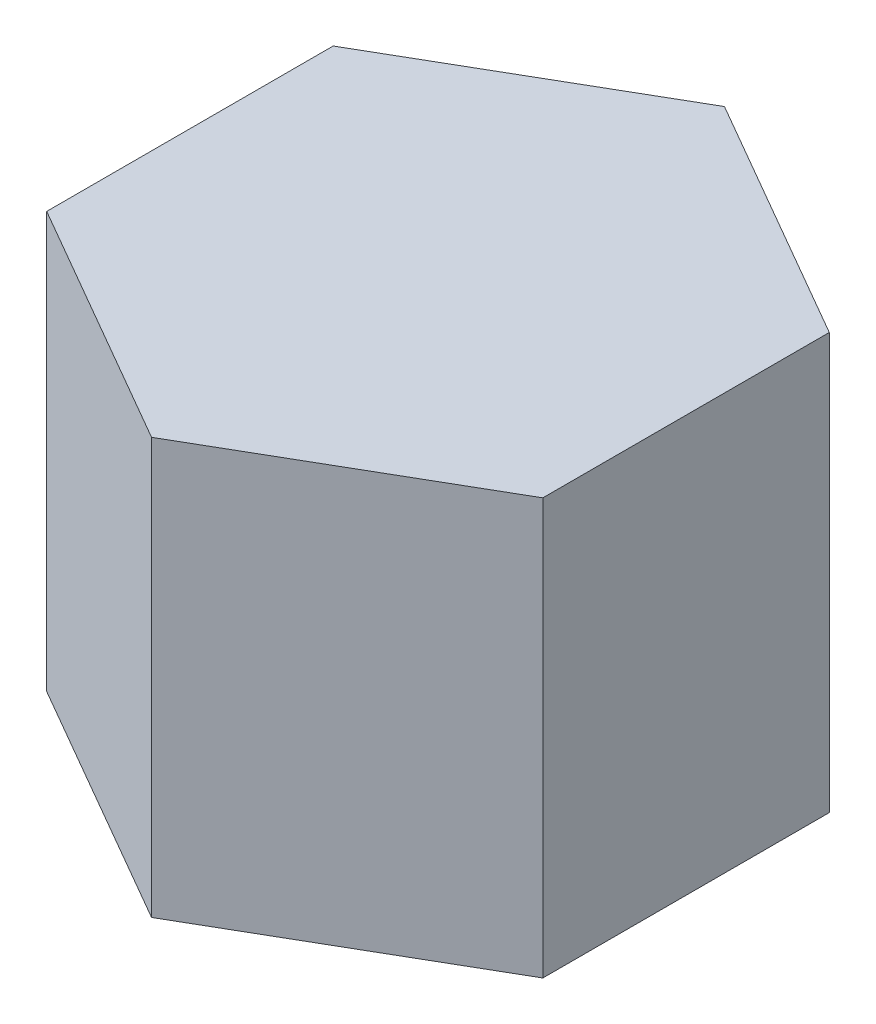
ISO-10303-21;
HEADER;
FILE_DESCRIPTION(('STEP AP214'),'2;1');
FILE_NAME('part.step','',(''),(''),'','','');
FILE_SCHEMA(('AUTOMOTIVE_DESIGN { 1 0 10303 214 1 1 1 1 }'));
ENDSEC;
DATA;
#1=APPLICATION_CONTEXT('core data for automotive mechanical design processes');
#2=APPLICATION_PROTOCOL_DEFINITION('international standard','automotive_design',2000,#1);
#3=PRODUCT_CONTEXT('',#1,'mechanical');
#4=PRODUCT('Part','Part','',(#3));
#5=PRODUCT_RELATED_PRODUCT_CATEGORY('part','',(#4));
#6=PRODUCT_DEFINITION_FORMATION('','',#4);
#7=PRODUCT_DEFINITION_CONTEXT('part definition',#1,'design');
#8=PRODUCT_DEFINITION('design','',#6,#7);
#9=PRODUCT_DEFINITION_SHAPE('','',#8);
#10=(LENGTH_UNIT() NAMED_UNIT(*) SI_UNIT(.MILLI.,.METRE.));
#11=(NAMED_UNIT(*) PLANE_ANGLE_UNIT() SI_UNIT($,.RADIAN.));
#12=(NAMED_UNIT(*) SI_UNIT($,.STERADIAN.) SOLID_ANGLE_UNIT());
#13=UNCERTAINTY_MEASURE_WITH_UNIT(LENGTH_MEASURE(1.E-05),#10,'distance_accuracy_value','');
#14=(GEOMETRIC_REPRESENTATION_CONTEXT(3) GLOBAL_UNCERTAINTY_ASSIGNED_CONTEXT((#13)) GLOBAL_UNIT_ASSIGNED_CONTEXT((#10,
#11,#12)) REPRESENTATION_CONTEXT('',''));
#15=CARTESIAN_POINT('',(0.,0.,0.));
#16=DIRECTION('',(0.,0.,1.));
#17=DIRECTION('',(1.,0.,0.));
#18=AXIS2_PLACEMENT_3D('',#15,#16,#17);
#19=CARTESIAN_POINT('',(202.142660308706,-148.537700895744,294.105047431848));
#20=DIRECTION('',(-0.500000000000028,0.,-0.866025403784423));
#21=DIRECTION('',(-0.866025403784423,0.,0.500000000000028));
#22=AXIS2_PLACEMENT_3D('',#19,#20,#21);
#23=PLANE('',#22);
#24=CARTESIAN_POINT('',(201.839551417382,-149.045793579175,294.280047431848));
#25=DIRECTION('',(0.866025403784422,0.,-0.500000000000028));
#26=VECTOR('',#25,1.);
#27=LINE('',#24,#26);
#28=CARTESIAN_POINT('',(201.839551417382,-149.045793579175,294.280047431848));
#29=VERTEX_POINT('',#28);
#30=CARTESIAN_POINT('',(202.142660308706,-149.045793579175,294.105047431848));
#31=VERTEX_POINT('',#30);
#32=EDGE_CURVE('E170',#29,#31,#27,.T.);
#33=ORIENTED_EDGE('',*,*,#32,.T.);
#34=CARTESIAN_POINT('',(202.142660308706,-148.537700895744,294.105047431848));
#35=DIRECTION('',(0.,-1.,0.));
#36=VECTOR('',#35,1.);
#37=LINE('',#34,#36);
#38=CARTESIAN_POINT('',(202.142660308706,-148.537700895744,294.105047431848));
#39=VERTEX_POINT('',#38);
#40=EDGE_CURVE('E35',#39,#31,#37,.T.);
#41=ORIENTED_EDGE('',*,*,#40,.F.);
#42=CARTESIAN_POINT('',(201.839551417382,-148.537700895744,294.280047431848));
#43=DIRECTION('',(0.866025403784422,0.,-0.500000000000028));
#44=VECTOR('',#43,1.);
#45=LINE('',#42,#44);
#46=CARTESIAN_POINT('',(201.839551417382,-148.537700895744,294.280047431848));
#47=VERTEX_POINT('',#46);
#48=EDGE_CURVE('E159',#47,#39,#45,.T.);
#49=ORIENTED_EDGE('',*,*,#48,.F.);
#50=CARTESIAN_POINT('',(201.839551417382,-148.537700895744,294.280047431848));
#51=DIRECTION('',(0.,-1.,0.));
#52=VECTOR('',#51,1.);
#53=LINE('',#50,#52);
#54=EDGE_CURVE('E10',#47,#29,#53,.T.);
#55=ORIENTED_EDGE('',*,*,#54,.T.);
#56=EDGE_LOOP('',(#33,#41,#49,#55));
#57=FACE_BOUND('',#56,.T.);
#58=ADVANCED_FACE('F16',(#57),#23,.F.);
#59=CARTESIAN_POINT('',(201.839551417382,-148.537700895744,294.280047431848));
#60=DIRECTION('',(0.499999999999978,0.,-0.866025403784452));
#61=DIRECTION('',(-0.866025403784452,0.,-0.499999999999978));
#62=AXIS2_PLACEMENT_3D('',#59,#60,#61);
#63=PLANE('',#62);
#64=CARTESIAN_POINT('',(201.536442526057,-149.045793579175,294.105047431848));
#65=DIRECTION('',(0.866025403784452,0.,0.499999999999978));
#66=VECTOR('',#65,1.);
#67=LINE('',#64,#66);
#68=CARTESIAN_POINT('',(201.536442526057,-149.045793579175,294.105047431848));
#69=VERTEX_POINT('',#68);
#70=EDGE_CURVE('E167',#69,#29,#67,.T.);
#71=ORIENTED_EDGE('',*,*,#70,.T.);
#72=ORIENTED_EDGE('',*,*,#54,.F.);
#73=CARTESIAN_POINT('',(201.536442526057,-148.537700895744,294.105047431848));
#74=DIRECTION('',(0.866025403784452,0.,0.499999999999978));
#75=VECTOR('',#74,1.);
#76=LINE('',#73,#75);
#77=CARTESIAN_POINT('',(201.536442526057,-148.537700895744,294.105047431848));
#78=VERTEX_POINT('',#77);
#79=EDGE_CURVE('E156',#78,#47,#76,.T.);
#80=ORIENTED_EDGE('',*,*,#79,.F.);
#81=CARTESIAN_POINT('',(201.536442526057,-148.537700895744,294.105047431848));
#82=DIRECTION('',(0.,-1.,0.));
#83=VECTOR('',#82,1.);
#84=LINE('',#81,#83);
#85=EDGE_CURVE('E27',#78,#69,#84,.T.);
#86=ORIENTED_EDGE('',*,*,#85,.T.);
#87=EDGE_LOOP('',(#71,#72,#80,#86));
#88=FACE_BOUND('',#87,.T.);
#89=ADVANCED_FACE('F189',(#88),#63,.F.);
#90=CARTESIAN_POINT('',(201.536442526057,-148.537700895744,290.831971220494));
#91=DIRECTION('',(1.,0.,0.));
#92=DIRECTION('',(0.,1.,0.));
#93=AXIS2_PLACEMENT_3D('',#90,#91,#92);
#94=PLANE('',#93);
#95=CARTESIAN_POINT('',(201.536442526057,-149.045793579175,293.755047431848));
#96=DIRECTION('',(0.,0.,1.));
#97=VECTOR('',#96,1.);
#98=LINE('',#95,#97);
#99=CARTESIAN_POINT('',(201.536442526057,-149.045793579175,293.755047431848));
#100=VERTEX_POINT('',#99);
#101=EDGE_CURVE('E163',#100,#69,#98,.T.);
#102=ORIENTED_EDGE('',*,*,#101,.T.);
#103=ORIENTED_EDGE('',*,*,#85,.F.);
#104=CARTESIAN_POINT('',(201.536442526057,-148.537700895744,293.755047431848));
#105=DIRECTION('',(0.,0.,1.));
#106=VECTOR('',#105,1.);
#107=LINE('',#104,#106);
#108=CARTESIAN_POINT('',(201.536442526057,-148.537700895744,293.755047431848));
#109=VERTEX_POINT('',#108);
#110=EDGE_CURVE('E106',#109,#78,#107,.T.);
#111=ORIENTED_EDGE('',*,*,#110,.F.);
#112=CARTESIAN_POINT('',(201.536442526057,-148.537700895744,293.755047431848));
#113=DIRECTION('',(0.,-1.,0.));
#114=VECTOR('',#113,1.);
#115=LINE('',#112,#114);
#116=EDGE_CURVE('E94',#109,#100,#115,.T.);
#117=ORIENTED_EDGE('',*,*,#116,.T.);
#118=EDGE_LOOP('',(#102,#103,#111,#117));
#119=FACE_BOUND('',#118,.T.);
#120=ADVANCED_FACE('F198',(#119),#94,.F.);
#121=CARTESIAN_POINT('',(201.536442526057,-148.537700895744,293.755047431848));
#122=DIRECTION('',(0.499999999999943,0.,0.866025403784472));
#123=DIRECTION('',(0.866025403784472,0.,-0.499999999999943));
#124=AXIS2_PLACEMENT_3D('',#121,#122,#123);
#125=PLANE('',#124);
#126=CARTESIAN_POINT('',(201.839551417382,-149.045793579175,293.580047431848));
#127=DIRECTION('',(-0.866025403784471,0.,0.499999999999943));
#128=VECTOR('',#127,1.);
#129=LINE('',#126,#128);
#130=CARTESIAN_POINT('',(201.839551417382,-149.045793579175,293.580047431848));
#131=VERTEX_POINT('',#130);
#132=EDGE_CURVE('E162',#131,#100,#129,.T.);
#133=ORIENTED_EDGE('',*,*,#132,.T.);
#134=ORIENTED_EDGE('',*,*,#116,.F.);
#135=CARTESIAN_POINT('',(201.839551417382,-148.537700895744,293.580047431848));
#136=DIRECTION('',(-0.866025403784471,0.,0.499999999999943));
#137=VECTOR('',#136,1.);
#138=LINE('',#135,#137);
#139=CARTESIAN_POINT('',(201.839551417382,-148.537700895744,293.580047431848));
#140=VERTEX_POINT('',#139);
#141=EDGE_CURVE('E98',#140,#109,#138,.T.);
#142=ORIENTED_EDGE('',*,*,#141,.F.);
#143=CARTESIAN_POINT('',(201.839551417382,-148.537700895744,293.580047431848));
#144=DIRECTION('',(0.,-1.,0.));
#145=VECTOR('',#144,1.);
#146=LINE('',#143,#145);
#147=EDGE_CURVE('E79',#140,#131,#146,.T.);
#148=ORIENTED_EDGE('',*,*,#147,.T.);
#149=EDGE_LOOP('',(#133,#134,#142,#148));
#150=FACE_BOUND('',#149,.T.);
#151=ADVANCED_FACE('F100',(#150),#125,.F.);
#152=CARTESIAN_POINT('',(201.839551417381,-148.537700895744,293.580047431848));
#153=DIRECTION('',(-0.500000000000028,0.,0.866025403784423));
#154=DIRECTION('',(0.866025403784423,0.,0.500000000000028));
#155=AXIS2_PLACEMENT_3D('',#152,#153,#154);
#156=PLANE('',#155);
#157=CARTESIAN_POINT('',(202.142660308706,-149.045793579175,293.755047431848));
#158=DIRECTION('',(-0.866025403784422,0.,-0.500000000000028));
#159=VECTOR('',#158,1.);
#160=LINE('',#157,#159);
#161=CARTESIAN_POINT('',(202.142660308706,-149.045793579175,293.755047431848));
#162=VERTEX_POINT('',#161);
#163=EDGE_CURVE('E88',#162,#131,#160,.T.);
#164=ORIENTED_EDGE('',*,*,#163,.T.);
#165=ORIENTED_EDGE('',*,*,#147,.F.);
#166=CARTESIAN_POINT('',(202.142660308706,-148.537700895744,293.755047431848));
#167=DIRECTION('',(-0.866025403784422,0.,-0.500000000000028));
#168=VECTOR('',#167,1.);
#169=LINE('',#166,#168);
#170=CARTESIAN_POINT('',(202.142660308706,-148.537700895744,293.755047431848));
#171=VERTEX_POINT('',#170);
#172=EDGE_CURVE('E84',#171,#140,#169,.T.);
#173=ORIENTED_EDGE('',*,*,#172,.F.);
#174=CARTESIAN_POINT('',(202.142660308706,-148.537700895744,293.755047431848));
#175=DIRECTION('',(0.,-1.,0.));
#176=VECTOR('',#175,1.);
#177=LINE('',#174,#176);
#178=EDGE_CURVE('E58',#171,#162,#177,.T.);
#179=ORIENTED_EDGE('',*,*,#178,.T.);
#180=EDGE_LOOP('',(#164,#165,#173,#179));
#181=FACE_BOUND('',#180,.T.);
#182=ADVANCED_FACE('F82',(#181),#156,.F.);
#183=CARTESIAN_POINT('',(202.142660308706,-148.537700895744,290.831971220494));
#184=DIRECTION('',(-1.,0.,0.));
#185=DIRECTION('',(0.,-1.,0.));
#186=AXIS2_PLACEMENT_3D('',#183,#184,#185);
#187=PLANE('',#186);
#188=CARTESIAN_POINT('',(202.142660308706,-149.045793579175,294.105047431848));
#189=DIRECTION('',(0.,0.,-1.));
#190=VECTOR('',#189,1.);
#191=LINE('',#188,#190);
#192=EDGE_CURVE('E160',#31,#162,#191,.T.);
#193=ORIENTED_EDGE('',*,*,#192,.T.);
#194=ORIENTED_EDGE('',*,*,#178,.F.);
#195=CARTESIAN_POINT('',(202.142660308706,-148.537700895744,294.105047431848));
#196=DIRECTION('',(0.,0.,-1.));
#197=VECTOR('',#196,1.);
#198=LINE('',#195,#197);
#199=EDGE_CURVE('E112',#39,#171,#198,.T.);
#200=ORIENTED_EDGE('',*,*,#199,.F.);
#201=ORIENTED_EDGE('',*,*,#40,.T.);
#202=EDGE_LOOP('',(#193,#194,#200,#201));
#203=FACE_BOUND('',#202,.T.);
#204=ADVANCED_FACE('F131',(#203),#187,.F.);
#205=CARTESIAN_POINT('',(206.339551417382,-148.537700895744,290.831971220494));
#206=DIRECTION('',(0.,-1.,0.));
#207=DIRECTION('',(1.,0.,0.));
#208=AXIS2_PLACEMENT_3D('',#205,#206,#207);
#209=PLANE('',#208);
#210=ORIENTED_EDGE('',*,*,#48,.T.);
#211=ORIENTED_EDGE('',*,*,#199,.T.);
#212=ORIENTED_EDGE('',*,*,#172,.T.);
#213=ORIENTED_EDGE('',*,*,#141,.T.);
#214=ORIENTED_EDGE('',*,*,#110,.T.);
#215=ORIENTED_EDGE('',*,*,#79,.T.);
#216=EDGE_LOOP('',(#210,#211,#212,#213,#214,#215));
#217=FACE_BOUND('',#216,.T.);
#218=ADVANCED_FACE('F111',(#217),#209,.F.);
#219=CARTESIAN_POINT('',(206.339551417382,-149.045793579175,290.831971220494));
#220=DIRECTION('',(0.,-1.,0.));
#221=DIRECTION('',(1.,0.,0.));
#222=AXIS2_PLACEMENT_3D('',#219,#220,#221);
#223=PLANE('',#222);
#224=ORIENTED_EDGE('',*,*,#32,.F.);
#225=ORIENTED_EDGE('',*,*,#70,.F.);
#226=ORIENTED_EDGE('',*,*,#101,.F.);
#227=ORIENTED_EDGE('',*,*,#132,.F.);
#228=ORIENTED_EDGE('',*,*,#163,.F.);
#229=ORIENTED_EDGE('',*,*,#192,.F.);
#230=EDGE_LOOP('',(#224,#225,#226,#227,#228,#229));
#231=FACE_BOUND('',#230,.T.);
#232=ADVANCED_FACE('F130',(#231),#223,.T.);
#233=CLOSED_SHELL('',(#58,#89,#120,#151,#182,#204,#218,#232));
#234=MANIFOLD_SOLID_BREP('B1',#233);
#235=ADVANCED_BREP_SHAPE_REPRESENTATION('',(#18,#234),#14);
#236=SHAPE_DEFINITION_REPRESENTATION(#9,#235);
ENDSEC;
END-ISO-10303-21;
